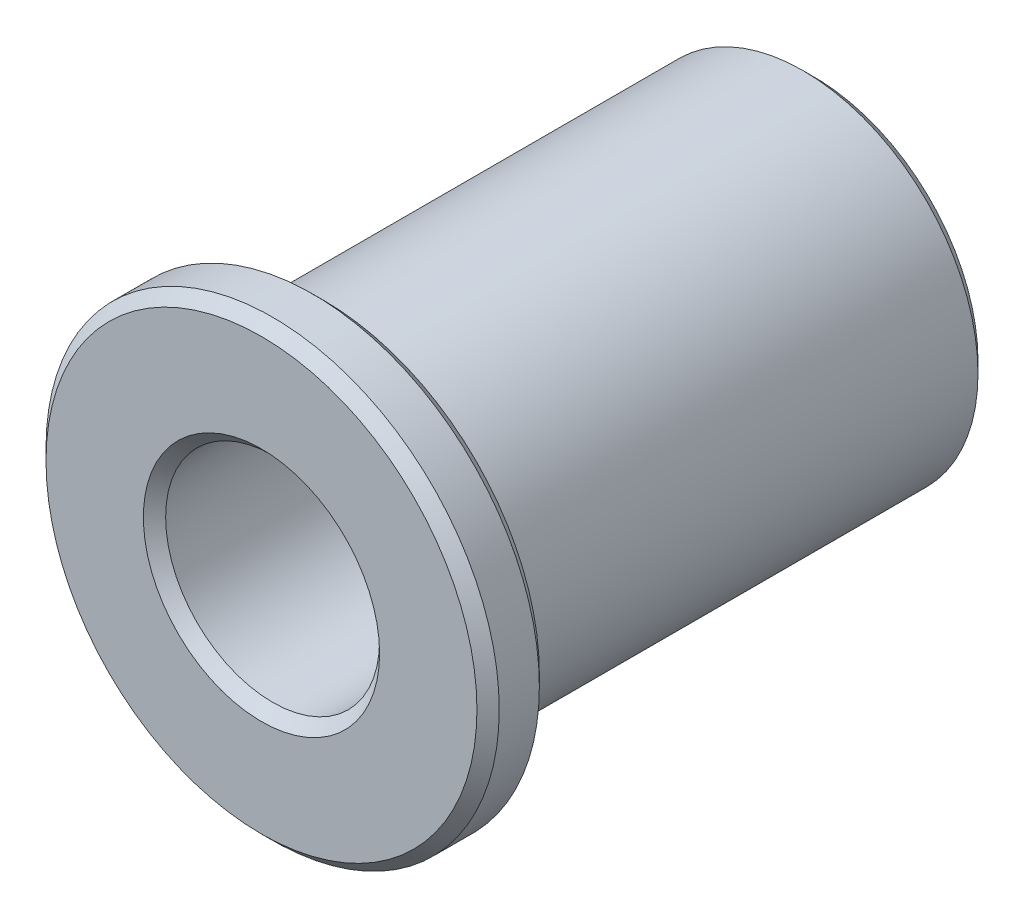
ISO-10303-21;
HEADER;
FILE_DESCRIPTION(('STEP AP214'),'2;1');
FILE_NAME('part.step','',(''),(''),'','','');
FILE_SCHEMA(('AUTOMOTIVE_DESIGN { 1 0 10303 214 1 1 1 1 }'));
ENDSEC;
DATA;
#1=APPLICATION_CONTEXT('core data for automotive mechanical design processes');
#2=APPLICATION_PROTOCOL_DEFINITION('international standard','automotive_design',2000,#1);
#3=PRODUCT_CONTEXT('',#1,'mechanical');
#4=PRODUCT('Part','Part','',(#3));
#5=PRODUCT_RELATED_PRODUCT_CATEGORY('part','',(#4));
#6=PRODUCT_DEFINITION_FORMATION('','',#4);
#7=PRODUCT_DEFINITION_CONTEXT('part definition',#1,'design');
#8=PRODUCT_DEFINITION('design','',#6,#7);
#9=PRODUCT_DEFINITION_SHAPE('','',#8);
#10=(LENGTH_UNIT() NAMED_UNIT(*) SI_UNIT(.MILLI.,.METRE.));
#11=(NAMED_UNIT(*) PLANE_ANGLE_UNIT() SI_UNIT($,.RADIAN.));
#12=(NAMED_UNIT(*) SI_UNIT($,.STERADIAN.) SOLID_ANGLE_UNIT());
#13=UNCERTAINTY_MEASURE_WITH_UNIT(LENGTH_MEASURE(1.E-05),#10,'distance_accuracy_value','');
#14=(GEOMETRIC_REPRESENTATION_CONTEXT(3) GLOBAL_UNCERTAINTY_ASSIGNED_CONTEXT((#13)) GLOBAL_UNIT_ASSIGNED_CONTEXT((#10,
#11,#12)) REPRESENTATION_CONTEXT('',''));
#15=CARTESIAN_POINT('',(0.,0.,0.));
#16=DIRECTION('',(0.,0.,1.));
#17=DIRECTION('',(1.,0.,0.));
#18=AXIS2_PLACEMENT_3D('',#15,#16,#17);
#19=CARTESIAN_POINT('',(0.,0.,-11.));
#20=DIRECTION('',(0.,0.,1.));
#21=DIRECTION('',(1.,0.,0.));
#22=AXIS2_PLACEMENT_3D('',#19,#20,#21);
#23=CYLINDRICAL_SURFACE('',#22,3.925);
#24=CARTESIAN_POINT('',(0.,0.,-10.75));
#25=DIRECTION('',(0.,0.,1.));
#26=DIRECTION('',(1.,0.,0.));
#27=AXIS2_PLACEMENT_3D('',#24,#25,#26);
#28=CIRCLE('',#27,3.925);
#29=CARTESIAN_POINT('',(3.925,0.,-10.75));
#30=VERTEX_POINT('',#29);
#31=EDGE_CURVE('E50',#30,#30,#28,.T.);
#32=ORIENTED_EDGE('',*,*,#31,.T.);
#33=EDGE_LOOP('',(#32));
#34=FACE_BOUND('',#33,.T.);
#35=CARTESIAN_POINT('',(0.,0.,0.));
#36=DIRECTION('',(0.,0.,1.));
#37=DIRECTION('',(1.,0.,0.));
#38=AXIS2_PLACEMENT_3D('',#35,#36,#37);
#39=CIRCLE('',#38,3.925);
#40=CARTESIAN_POINT('',(3.925,0.,0.));
#41=VERTEX_POINT('',#40);
#42=EDGE_CURVE('E68',#41,#41,#39,.T.);
#43=ORIENTED_EDGE('',*,*,#42,.F.);
#44=EDGE_LOOP('',(#43));
#45=FACE_BOUND('',#44,.T.);
#46=ADVANCED_FACE('F30',(#34,#45),#23,.T.);
#47=CARTESIAN_POINT('',(0.,0.,-11.));
#48=DIRECTION('',(0.,0.,1.));
#49=DIRECTION('',(1.,0.,0.));
#50=AXIS2_PLACEMENT_3D('',#47,#48,#49);
#51=PLANE('',#50);
#52=CARTESIAN_POINT('',(0.,0.,-11.));
#53=DIRECTION('',(0.,0.,1.));
#54=DIRECTION('',(1.,0.,0.));
#55=AXIS2_PLACEMENT_3D('',#52,#53,#54);
#56=CIRCLE('',#55,3.67499999999999);
#57=CARTESIAN_POINT('',(3.67499999999999,0.,-11.));
#58=VERTEX_POINT('',#57);
#59=EDGE_CURVE('E41',#58,#58,#56,.F.);
#60=ORIENTED_EDGE('',*,*,#59,.T.);
#61=EDGE_LOOP('',(#60));
#62=FACE_BOUND('',#61,.T.);
#63=CARTESIAN_POINT('',(0.,0.,-11.));
#64=DIRECTION('',(0.,0.,1.));
#65=DIRECTION('',(1.,0.,0.));
#66=AXIS2_PLACEMENT_3D('',#63,#64,#65);
#67=CIRCLE('',#66,2.64999999999999);
#68=CARTESIAN_POINT('',(2.64999999999999,0.,-11.));
#69=VERTEX_POINT('',#68);
#70=EDGE_CURVE('E45',#69,#69,#67,.T.);
#71=ORIENTED_EDGE('',*,*,#70,.T.);
#72=EDGE_LOOP('',(#71));
#73=FACE_BOUND('',#72,.T.);
#74=ADVANCED_FACE('F75',(#62,#73),#51,.F.);
#75=CARTESIAN_POINT('',(0.,0.,1.4));
#76=DIRECTION('',(0.,0.,-1.));
#77=DIRECTION('',(-1.,0.,0.));
#78=AXIS2_PLACEMENT_3D('',#75,#76,#77);
#79=CYLINDRICAL_SURFACE('',#78,5.08414963527469);
#80=CARTESIAN_POINT('',(0.,0.,0.250000000000003));
#81=DIRECTION('',(0.,0.,1.));
#82=DIRECTION('',(1.,0.,0.));
#83=AXIS2_PLACEMENT_3D('',#80,#81,#82);
#84=CIRCLE('',#83,5.08414963527469);
#85=CARTESIAN_POINT('',(5.08414963527469,0.,0.250000000000003));
#86=VERTEX_POINT('',#85);
#87=EDGE_CURVE('E62',#86,#86,#84,.T.);
#88=ORIENTED_EDGE('',*,*,#87,.T.);
#89=EDGE_LOOP('',(#88));
#90=FACE_BOUND('',#89,.T.);
#91=CARTESIAN_POINT('',(0.,0.,1.15));
#92=DIRECTION('',(0.,0.,1.));
#93=DIRECTION('',(1.,0.,0.));
#94=AXIS2_PLACEMENT_3D('',#91,#92,#93);
#95=CIRCLE('',#94,5.08414963527469);
#96=CARTESIAN_POINT('',(5.08414963527469,0.,1.15));
#97=VERTEX_POINT('',#96);
#98=EDGE_CURVE('E65',#97,#97,#95,.F.);
#99=ORIENTED_EDGE('',*,*,#98,.T.);
#100=EDGE_LOOP('',(#99));
#101=FACE_BOUND('',#100,.T.);
#102=ADVANCED_FACE('F81',(#90,#101),#79,.T.);
#103=CARTESIAN_POINT('',(0.,0.,1.4));
#104=DIRECTION('',(0.,0.,1.));
#105=DIRECTION('',(1.,0.,0.));
#106=AXIS2_PLACEMENT_3D('',#103,#104,#105);
#107=PLANE('',#106);
#108=CARTESIAN_POINT('',(0.,0.,1.4));
#109=DIRECTION('',(0.,0.,1.));
#110=DIRECTION('',(1.,0.,0.));
#111=AXIS2_PLACEMENT_3D('',#108,#109,#110);
#112=CIRCLE('',#111,4.83414963527468);
#113=CARTESIAN_POINT('',(4.83414963527468,0.,1.4));
#114=VERTEX_POINT('',#113);
#115=EDGE_CURVE('E53',#114,#114,#112,.T.);
#116=ORIENTED_EDGE('',*,*,#115,.T.);
#117=EDGE_LOOP('',(#116));
#118=FACE_BOUND('',#117,.T.);
#119=CARTESIAN_POINT('',(0.,0.,1.4));
#120=DIRECTION('',(0.,0.,1.));
#121=DIRECTION('',(1.,0.,0.));
#122=AXIS2_PLACEMENT_3D('',#119,#120,#121);
#123=CIRCLE('',#122,2.65000000000001);
#124=CARTESIAN_POINT('',(2.65000000000001,0.,1.4));
#125=VERTEX_POINT('',#124);
#126=EDGE_CURVE('E56',#125,#125,#123,.F.);
#127=ORIENTED_EDGE('',*,*,#126,.T.);
#128=EDGE_LOOP('',(#127));
#129=FACE_BOUND('',#128,.T.);
#130=ADVANCED_FACE('F113',(#118,#129),#107,.T.);
#131=CARTESIAN_POINT('',(0.,0.,0.));
#132=DIRECTION('',(0.,0.,1.));
#133=DIRECTION('',(1.,0.,0.));
#134=AXIS2_PLACEMENT_3D('',#131,#132,#133);
#135=PLANE('',#134);
#136=CARTESIAN_POINT('',(0.,0.,0.));
#137=DIRECTION('',(0.,0.,1.));
#138=DIRECTION('',(1.,0.,0.));
#139=AXIS2_PLACEMENT_3D('',#136,#137,#138);
#140=CIRCLE('',#139,4.83414963527468);
#141=CARTESIAN_POINT('',(4.83414963527468,0.,0.));
#142=VERTEX_POINT('',#141);
#143=EDGE_CURVE('E59',#142,#142,#140,.F.);
#144=ORIENTED_EDGE('',*,*,#143,.T.);
#145=EDGE_LOOP('',(#144));
#146=FACE_BOUND('',#145,.T.);
#147=ORIENTED_EDGE('',*,*,#42,.T.);
#148=EDGE_LOOP('',(#147));
#149=FACE_BOUND('',#148,.T.);
#150=ADVANCED_FACE('F72',(#146,#149),#135,.F.);
#151=CARTESIAN_POINT('',(0.,0.,-11.));
#152=DIRECTION('',(0.,0.,1.));
#153=DIRECTION('',(1.,0.,0.));
#154=AXIS2_PLACEMENT_3D('',#151,#152,#153);
#155=CYLINDRICAL_SURFACE('',#154,2.4);
#156=CARTESIAN_POINT('',(0.,0.,-10.75));
#157=DIRECTION('',(0.,0.,1.));
#158=DIRECTION('',(1.,0.,0.));
#159=AXIS2_PLACEMENT_3D('',#156,#157,#158);
#160=CIRCLE('',#159,2.4);
#161=CARTESIAN_POINT('',(2.4,0.,-10.75));
#162=VERTEX_POINT('',#161);
#163=EDGE_CURVE('E10',#162,#162,#160,.F.);
#164=ORIENTED_EDGE('',*,*,#163,.T.);
#165=EDGE_LOOP('',(#164));
#166=FACE_BOUND('',#165,.T.);
#167=CARTESIAN_POINT('',(0.,0.,1.14999999999999));
#168=DIRECTION('',(0.,0.,1.));
#169=DIRECTION('',(1.,0.,0.));
#170=AXIS2_PLACEMENT_3D('',#167,#168,#169);
#171=CIRCLE('',#170,2.4);
#172=CARTESIAN_POINT('',(2.4,0.,1.14999999999999));
#173=VERTEX_POINT('',#172);
#174=EDGE_CURVE('E37',#173,#173,#171,.T.);
#175=ORIENTED_EDGE('',*,*,#174,.T.);
#176=EDGE_LOOP('',(#175));
#177=FACE_BOUND('',#176,.T.);
#178=ADVANCED_FACE('F90',(#166,#177),#155,.F.);
#179=CARTESIAN_POINT('',(0.,0.,0.250000000000003));
#180=DIRECTION('',(0.,0.,1.));
#181=DIRECTION('',(1.,0.,0.));
#182=AXIS2_PLACEMENT_3D('',#179,#180,#181);
#183=CONICAL_SURFACE('',#182,5.08414963527469,0.785398163397452);
#184=ORIENTED_EDGE('',*,*,#143,.F.);
#185=EDGE_LOOP('',(#184));
#186=FACE_BOUND('',#185,.T.);
#187=ORIENTED_EDGE('',*,*,#87,.F.);
#188=EDGE_LOOP('',(#187));
#189=FACE_BOUND('',#188,.T.);
#190=ADVANCED_FACE('F86',(#186,#189),#183,.T.);
#191=CARTESIAN_POINT('',(0.,0.,1.4));
#192=DIRECTION('',(0.,0.,-1.));
#193=DIRECTION('',(-1.,0.,0.));
#194=AXIS2_PLACEMENT_3D('',#191,#192,#193);
#195=CONICAL_SURFACE('',#194,4.83414963527468,0.785398163397452);
#196=ORIENTED_EDGE('',*,*,#98,.F.);
#197=EDGE_LOOP('',(#196));
#198=FACE_BOUND('',#197,.T.);
#199=ORIENTED_EDGE('',*,*,#115,.F.);
#200=EDGE_LOOP('',(#199));
#201=FACE_BOUND('',#200,.T.);
#202=ADVANCED_FACE('F89',(#198,#201),#195,.T.);
#203=CARTESIAN_POINT('',(0.,0.,-10.75));
#204=DIRECTION('',(0.,0.,1.));
#205=DIRECTION('',(1.,0.,0.));
#206=AXIS2_PLACEMENT_3D('',#203,#204,#205);
#207=CONICAL_SURFACE('',#206,3.925,0.785398163397452);
#208=ORIENTED_EDGE('',*,*,#59,.F.);
#209=EDGE_LOOP('',(#208));
#210=FACE_BOUND('',#209,.T.);
#211=ORIENTED_EDGE('',*,*,#31,.F.);
#212=EDGE_LOOP('',(#211));
#213=FACE_BOUND('',#212,.T.);
#214=ADVANCED_FACE('F94',(#210,#213),#207,.T.);
#215=CARTESIAN_POINT('',(0.,0.,-11.));
#216=DIRECTION('',(0.,0.,-1.));
#217=DIRECTION('',(-1.,0.,0.));
#218=AXIS2_PLACEMENT_3D('',#215,#216,#217);
#219=CONICAL_SURFACE('',#218,2.64999999999999,0.785398163397447);
#220=ORIENTED_EDGE('',*,*,#163,.F.);
#221=EDGE_LOOP('',(#220));
#222=FACE_BOUND('',#221,.T.);
#223=ORIENTED_EDGE('',*,*,#70,.F.);
#224=EDGE_LOOP('',(#223));
#225=FACE_BOUND('',#224,.T.);
#226=ADVANCED_FACE('F97',(#222,#225),#219,.F.);
#227=CARTESIAN_POINT('',(0.,0.,1.14999999999999));
#228=DIRECTION('',(0.,0.,1.));
#229=DIRECTION('',(1.,0.,0.));
#230=AXIS2_PLACEMENT_3D('',#227,#228,#229);
#231=CONICAL_SURFACE('',#230,2.4,0.785398163397453);
#232=ORIENTED_EDGE('',*,*,#126,.F.);
#233=EDGE_LOOP('',(#232));
#234=FACE_BOUND('',#233,.T.);
#235=ORIENTED_EDGE('',*,*,#174,.F.);
#236=EDGE_LOOP('',(#235));
#237=FACE_BOUND('',#236,.T.);
#238=ADVANCED_FACE('F32',(#234,#237),#231,.F.);
#239=CLOSED_SHELL('',(#46,#74,#102,#130,#150,#178,#190,#202,#214,#226,#238));
#240=MANIFOLD_SOLID_BREP('B2',#239);
#241=ADVANCED_BREP_SHAPE_REPRESENTATION('',(#18,#240),#14);
#242=SHAPE_DEFINITION_REPRESENTATION(#9,#241);
ENDSEC;
END-ISO-10303-21;
